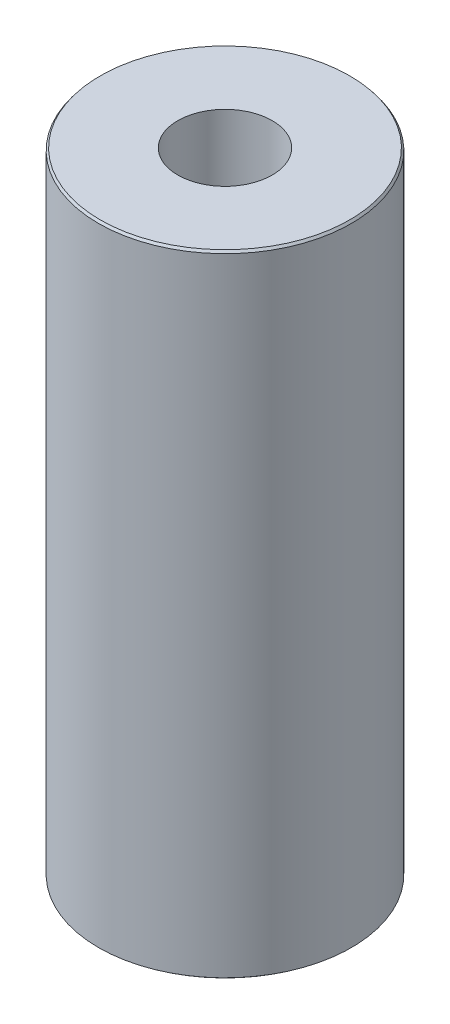
ISO-10303-21;
HEADER;
FILE_DESCRIPTION(('STEP AP214'),'2;1');
FILE_NAME('part.step','',(''),(''),'','','');
FILE_SCHEMA(('AUTOMOTIVE_DESIGN { 1 0 10303 214 1 1 1 1 }'));
ENDSEC;
DATA;
#1=APPLICATION_CONTEXT('core data for automotive mechanical design processes');
#2=APPLICATION_PROTOCOL_DEFINITION('international standard','automotive_design',2000,#1);
#3=PRODUCT_CONTEXT('',#1,'mechanical');
#4=PRODUCT('Part','Part','',(#3));
#5=PRODUCT_RELATED_PRODUCT_CATEGORY('part','',(#4));
#6=PRODUCT_DEFINITION_FORMATION('','',#4);
#7=PRODUCT_DEFINITION_CONTEXT('part definition',#1,'design');
#8=PRODUCT_DEFINITION('design','',#6,#7);
#9=PRODUCT_DEFINITION_SHAPE('','',#8);
#10=(LENGTH_UNIT() NAMED_UNIT(*) SI_UNIT(.MILLI.,.METRE.));
#11=(NAMED_UNIT(*) PLANE_ANGLE_UNIT() SI_UNIT($,.RADIAN.));
#12=(NAMED_UNIT(*) SI_UNIT($,.STERADIAN.) SOLID_ANGLE_UNIT());
#13=UNCERTAINTY_MEASURE_WITH_UNIT(LENGTH_MEASURE(1.E-05),#10,'distance_accuracy_value','');
#14=(GEOMETRIC_REPRESENTATION_CONTEXT(3) GLOBAL_UNCERTAINTY_ASSIGNED_CONTEXT((#13)) GLOBAL_UNIT_ASSIGNED_CONTEXT((#10,
#11,#12)) REPRESENTATION_CONTEXT('',''));
#15=CARTESIAN_POINT('',(0.,0.,0.));
#16=DIRECTION('',(0.,0.,1.));
#17=DIRECTION('',(1.,0.,0.));
#18=AXIS2_PLACEMENT_3D('',#15,#16,#17);
#19=CARTESIAN_POINT('',(0.,224.549064072793,0.));
#20=DIRECTION('',(0.,-1.,0.));
#21=DIRECTION('',(0.,0.,-1.));
#22=AXIS2_PLACEMENT_3D('',#19,#20,#21);
#23=CYLINDRICAL_SURFACE('',#22,45.);
#24=CARTESIAN_POINT('',(0.,223.748753184624,0.));
#25=DIRECTION('',(0.,1.,0.));
#26=DIRECTION('',(0.,0.,1.));
#27=AXIS2_PLACEMENT_3D('',#24,#25,#26);
#28=CIRCLE('',#27,45.);
#29=CARTESIAN_POINT('',(0.,223.748753184624,45.));
#30=VERTEX_POINT('',#29);
#31=EDGE_CURVE('E50',#30,#30,#28,.F.);
#32=ORIENTED_EDGE('',*,*,#31,.T.);
#33=EDGE_LOOP('',(#32));
#34=FACE_BOUND('',#33,.T.);
#35=CARTESIAN_POINT('',(0.,0.606850370668349,0.));
#36=DIRECTION('',(0.,1.,0.));
#37=DIRECTION('',(0.,0.,1.));
#38=AXIS2_PLACEMENT_3D('',#35,#36,#37);
#39=CIRCLE('',#38,45.);
#40=CARTESIAN_POINT('',(0.,0.606850370668349,45.));
#41=VERTEX_POINT('',#40);
#42=EDGE_CURVE('E51',#41,#41,#39,.T.);
#43=ORIENTED_EDGE('',*,*,#42,.T.);
#44=EDGE_LOOP('',(#43));
#45=FACE_BOUND('',#44,.T.);
#46=ADVANCED_FACE('F39',(#34,#45),#23,.T.);
#47=CARTESIAN_POINT('',(0.,224.549064072793,0.));
#48=DIRECTION('',(0.,1.,0.));
#49=DIRECTION('',(0.,0.,1.));
#50=AXIS2_PLACEMENT_3D('',#47,#48,#49);
#51=PLANE('',#50);
#52=CARTESIAN_POINT('',(0.,224.549064072793,0.));
#53=DIRECTION('',(0.,1.,0.));
#54=DIRECTION('',(0.,0.,1.));
#55=AXIS2_PLACEMENT_3D('',#52,#53,#54);
#56=CIRCLE('',#55,44.3931496293317);
#57=CARTESIAN_POINT('',(0.,224.549064072793,44.3931496293317));
#58=VERTEX_POINT('',#57);
#59=EDGE_CURVE('E54',#58,#58,#56,.T.);
#60=ORIENTED_EDGE('',*,*,#59,.T.);
#61=EDGE_LOOP('',(#60));
#62=FACE_BOUND('',#61,.T.);
#63=CARTESIAN_POINT('',(0.,224.549064072793,0.));
#64=DIRECTION('',(0.,1.,0.));
#65=DIRECTION('',(0.,0.,1.));
#66=AXIS2_PLACEMENT_3D('',#63,#64,#65);
#67=CIRCLE('',#66,16.7922157787475);
#68=CARTESIAN_POINT('',(0.,224.549064072793,16.7922157787475));
#69=VERTEX_POINT('',#68);
#70=EDGE_CURVE('E58',#69,#69,#67,.T.);
#71=ORIENTED_EDGE('',*,*,#70,.F.);
#72=EDGE_LOOP('',(#71));
#73=FACE_BOUND('',#72,.T.);
#74=ADVANCED_FACE('F69',(#62,#73),#51,.T.);
#75=CARTESIAN_POINT('',(0.,0.,0.));
#76=DIRECTION('',(0.,1.,0.));
#77=DIRECTION('',(0.,0.,1.));
#78=AXIS2_PLACEMENT_3D('',#75,#76,#77);
#79=PLANE('',#78);
#80=CARTESIAN_POINT('',(0.,0.,0.));
#81=DIRECTION('',(0.,1.,0.));
#82=DIRECTION('',(0.,0.,1.));
#83=AXIS2_PLACEMENT_3D('',#80,#81,#82);
#84=CIRCLE('',#83,44.1996891118318);
#85=CARTESIAN_POINT('',(0.,0.,44.1996891118318));
#86=VERTEX_POINT('',#85);
#87=EDGE_CURVE('E10',#86,#86,#84,.F.);
#88=ORIENTED_EDGE('',*,*,#87,.T.);
#89=EDGE_LOOP('',(#88));
#90=FACE_BOUND('',#89,.T.);
#91=CARTESIAN_POINT('',(0.,0.,0.));
#92=DIRECTION('',(0.,1.,0.));
#93=DIRECTION('',(0.,0.,1.));
#94=AXIS2_PLACEMENT_3D('',#91,#92,#93);
#95=CIRCLE('',#94,16.7922157787475);
#96=CARTESIAN_POINT('',(0.,0.,16.7922157787475));
#97=VERTEX_POINT('',#96);
#98=EDGE_CURVE('E63',#97,#97,#95,.T.);
#99=ORIENTED_EDGE('',*,*,#98,.T.);
#100=EDGE_LOOP('',(#99));
#101=FACE_BOUND('',#100,.T.);
#102=ADVANCED_FACE('F75',(#90,#101),#79,.F.);
#103=CARTESIAN_POINT('',(0.,224.549064072793,0.));
#104=DIRECTION('',(0.,-1.,0.));
#105=DIRECTION('',(0.,0.,-1.));
#106=AXIS2_PLACEMENT_3D('',#103,#104,#105);
#107=CYLINDRICAL_SURFACE('',#106,16.7922157787475);
#108=ORIENTED_EDGE('',*,*,#70,.T.);
#109=EDGE_LOOP('',(#108));
#110=FACE_BOUND('',#109,.T.);
#111=ORIENTED_EDGE('',*,*,#98,.F.);
#112=EDGE_LOOP('',(#111));
#113=FACE_BOUND('',#112,.T.);
#114=ADVANCED_FACE('F70',(#110,#113),#107,.F.);
#115=CARTESIAN_POINT('',(0.,224.549064072793,0.));
#116=DIRECTION('',(0.,-1.,0.));
#117=DIRECTION('',(0.,0.,-1.));
#118=AXIS2_PLACEMENT_3D('',#115,#116,#117);
#119=CONICAL_SURFACE('',#118,44.3931496293317,0.648771848604083);
#120=ORIENTED_EDGE('',*,*,#31,.F.);
#121=EDGE_LOOP('',(#120));
#122=FACE_BOUND('',#121,.T.);
#123=ORIENTED_EDGE('',*,*,#59,.F.);
#124=EDGE_LOOP('',(#123));
#125=FACE_BOUND('',#124,.T.);
#126=ADVANCED_FACE('F81',(#122,#125),#119,.T.);
#127=CARTESIAN_POINT('',(0.,0.606850370668349,0.));
#128=DIRECTION('',(0.,1.,0.));
#129=DIRECTION('',(0.,0.,1.));
#130=AXIS2_PLACEMENT_3D('',#127,#128,#129);
#131=CONICAL_SURFACE('',#130,45.,0.922024478190815);
#132=ORIENTED_EDGE('',*,*,#87,.F.);
#133=EDGE_LOOP('',(#132));
#134=FACE_BOUND('',#133,.T.);
#135=ORIENTED_EDGE('',*,*,#42,.F.);
#136=EDGE_LOOP('',(#135));
#137=FACE_BOUND('',#136,.T.);
#138=ADVANCED_FACE('F45',(#134,#137),#131,.T.);
#139=CLOSED_SHELL('',(#46,#74,#102,#114,#126,#138));
#140=MANIFOLD_SOLID_BREP('B2',#139);
#141=ADVANCED_BREP_SHAPE_REPRESENTATION('',(#18,#140),#14);
#142=SHAPE_DEFINITION_REPRESENTATION(#9,#141);
ENDSEC;
END-ISO-10303-21;
